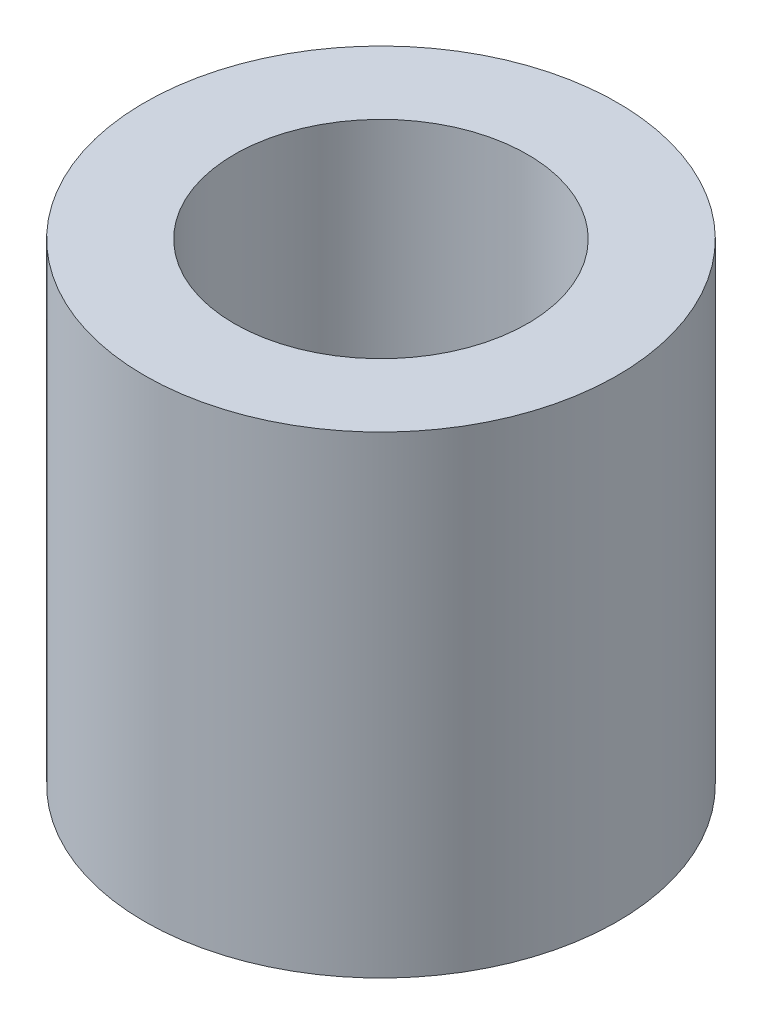
ISO-10303-21;
HEADER;
FILE_DESCRIPTION(('STEP AP214'),'2;1');
FILE_NAME('part.step','',(''),(''),'','','');
FILE_SCHEMA(('AUTOMOTIVE_DESIGN { 1 0 10303 214 1 1 1 1 }'));
ENDSEC;
DATA;
#1=APPLICATION_CONTEXT('core data for automotive mechanical design processes');
#2=APPLICATION_PROTOCOL_DEFINITION('international standard','automotive_design',2000,#1);
#3=PRODUCT_CONTEXT('',#1,'mechanical');
#4=PRODUCT('Part','Part','',(#3));
#5=PRODUCT_RELATED_PRODUCT_CATEGORY('part','',(#4));
#6=PRODUCT_DEFINITION_FORMATION('','',#4);
#7=PRODUCT_DEFINITION_CONTEXT('part definition',#1,'design');
#8=PRODUCT_DEFINITION('design','',#6,#7);
#9=PRODUCT_DEFINITION_SHAPE('','',#8);
#10=(LENGTH_UNIT() NAMED_UNIT(*) SI_UNIT(.MILLI.,.METRE.));
#11=(NAMED_UNIT(*) PLANE_ANGLE_UNIT() SI_UNIT($,.RADIAN.));
#12=(NAMED_UNIT(*) SI_UNIT($,.STERADIAN.) SOLID_ANGLE_UNIT());
#13=UNCERTAINTY_MEASURE_WITH_UNIT(LENGTH_MEASURE(1.E-05),#10,'distance_accuracy_value','');
#14=(GEOMETRIC_REPRESENTATION_CONTEXT(3) GLOBAL_UNCERTAINTY_ASSIGNED_CONTEXT((#13)) GLOBAL_UNIT_ASSIGNED_CONTEXT((#10,
#11,#12)) REPRESENTATION_CONTEXT('',''));
#15=CARTESIAN_POINT('',(0.,0.,0.));
#16=DIRECTION('',(0.,0.,1.));
#17=DIRECTION('',(1.,0.,0.));
#18=AXIS2_PLACEMENT_3D('',#15,#16,#17);
#19=CARTESIAN_POINT('',(0.,5.,0.));
#20=DIRECTION('',(0.,1.,0.));
#21=DIRECTION('',(0.,0.,1.));
#22=AXIS2_PLACEMENT_3D('',#19,#20,#21);
#23=PLANE('',#22);
#24=CARTESIAN_POINT('',(0.,5.,0.));
#25=DIRECTION('',(0.,1.,0.));
#26=DIRECTION('',(0.,0.,1.));
#27=AXIS2_PLACEMENT_3D('',#24,#25,#26);
#28=CIRCLE('',#27,2.5);
#29=CARTESIAN_POINT('',(0.,5.,2.5));
#30=VERTEX_POINT('',#29);
#31=EDGE_CURVE('E10',#30,#30,#28,.T.);
#32=ORIENTED_EDGE('',*,*,#31,.T.);
#33=EDGE_LOOP('',(#32));
#34=FACE_BOUND('',#33,.T.);
#35=CARTESIAN_POINT('',(0.,5.,0.));
#36=DIRECTION('',(0.,1.,0.));
#37=DIRECTION('',(0.,0.,1.));
#38=AXIS2_PLACEMENT_3D('',#35,#36,#37);
#39=CIRCLE('',#38,1.55);
#40=CARTESIAN_POINT('',(0.,5.,1.55));
#41=VERTEX_POINT('',#40);
#42=EDGE_CURVE('E43',#41,#41,#39,.T.);
#43=ORIENTED_EDGE('',*,*,#42,.F.);
#44=EDGE_LOOP('',(#43));
#45=FACE_BOUND('',#44,.T.);
#46=ADVANCED_FACE('F32',(#34,#45),#23,.T.);
#47=CARTESIAN_POINT('',(0.,0.,0.));
#48=DIRECTION('',(0.,1.,0.));
#49=DIRECTION('',(0.,0.,1.));
#50=AXIS2_PLACEMENT_3D('',#47,#48,#49);
#51=PLANE('',#50);
#52=CARTESIAN_POINT('',(0.,0.,0.));
#53=DIRECTION('',(0.,1.,0.));
#54=DIRECTION('',(0.,0.,1.));
#55=AXIS2_PLACEMENT_3D('',#52,#53,#54);
#56=CIRCLE('',#55,2.5);
#57=CARTESIAN_POINT('',(0.,0.,2.5));
#58=VERTEX_POINT('',#57);
#59=EDGE_CURVE('E36',#58,#58,#56,.T.);
#60=ORIENTED_EDGE('',*,*,#59,.F.);
#61=EDGE_LOOP('',(#60));
#62=FACE_BOUND('',#61,.T.);
#63=CARTESIAN_POINT('',(0.,0.,0.));
#64=DIRECTION('',(0.,1.,0.));
#65=DIRECTION('',(0.,0.,1.));
#66=AXIS2_PLACEMENT_3D('',#63,#64,#65);
#67=CIRCLE('',#66,1.55);
#68=CARTESIAN_POINT('',(0.,0.,1.55));
#69=VERTEX_POINT('',#68);
#70=EDGE_CURVE('E45',#69,#69,#67,.T.);
#71=ORIENTED_EDGE('',*,*,#70,.T.);
#72=EDGE_LOOP('',(#71));
#73=FACE_BOUND('',#72,.T.);
#74=ADVANCED_FACE('F55',(#62,#73),#51,.F.);
#75=CARTESIAN_POINT('',(0.,5.,0.));
#76=DIRECTION('',(0.,-1.,0.));
#77=DIRECTION('',(0.,0.,-1.));
#78=AXIS2_PLACEMENT_3D('',#75,#76,#77);
#79=CYLINDRICAL_SURFACE('',#78,2.5);
#80=ORIENTED_EDGE('',*,*,#31,.F.);
#81=EDGE_LOOP('',(#80));
#82=FACE_BOUND('',#81,.T.);
#83=ORIENTED_EDGE('',*,*,#59,.T.);
#84=EDGE_LOOP('',(#83));
#85=FACE_BOUND('',#84,.T.);
#86=ADVANCED_FACE('F34',(#82,#85),#79,.T.);
#87=CARTESIAN_POINT('',(0.,5.,0.));
#88=DIRECTION('',(0.,-1.,0.));
#89=DIRECTION('',(0.,0.,-1.));
#90=AXIS2_PLACEMENT_3D('',#87,#88,#89);
#91=CYLINDRICAL_SURFACE('',#90,1.55);
#92=ORIENTED_EDGE('',*,*,#42,.T.);
#93=EDGE_LOOP('',(#92));
#94=FACE_BOUND('',#93,.T.);
#95=ORIENTED_EDGE('',*,*,#70,.F.);
#96=EDGE_LOOP('',(#95));
#97=FACE_BOUND('',#96,.T.);
#98=ADVANCED_FACE('F51',(#94,#97),#91,.F.);
#99=CLOSED_SHELL('',(#46,#74,#86,#98));
#100=MANIFOLD_SOLID_BREP('B2',#99);
#101=ADVANCED_BREP_SHAPE_REPRESENTATION('',(#18,#100),#14);
#102=SHAPE_DEFINITION_REPRESENTATION(#9,#101);
ENDSEC;
END-ISO-10303-21;
